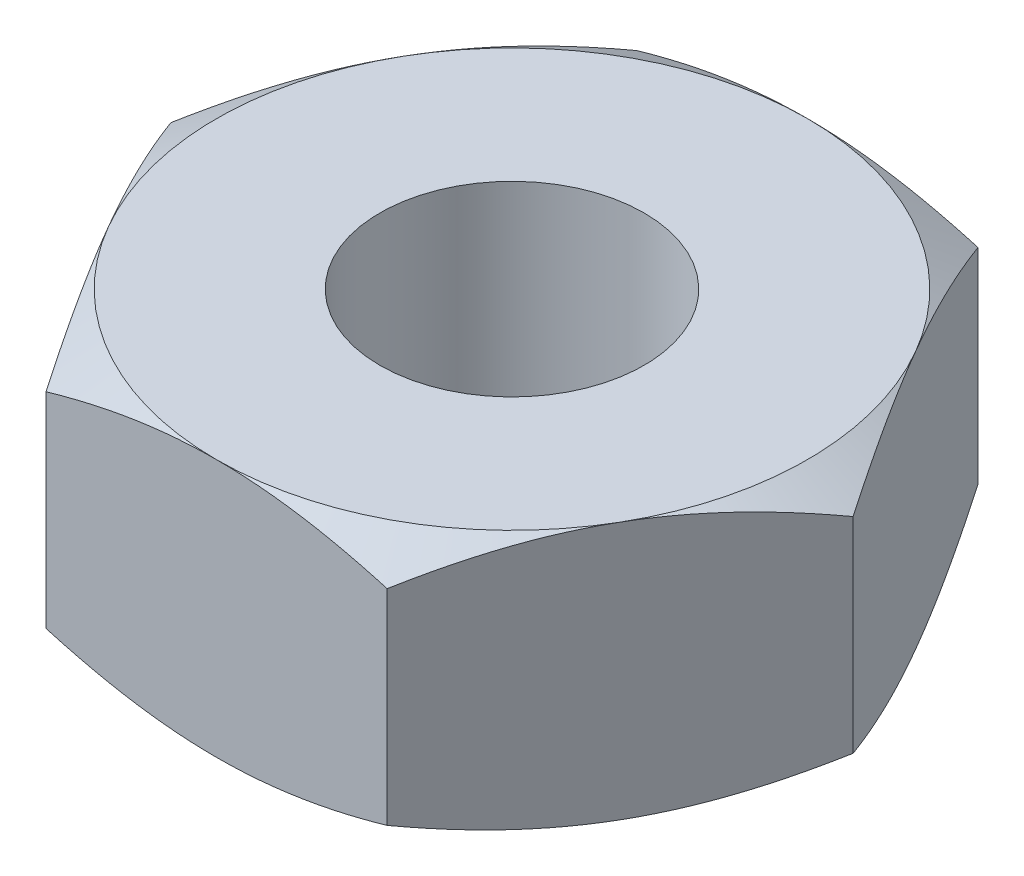
ISO-10303-21;
HEADER;
FILE_DESCRIPTION(('STEP AP214'),'2;1');
FILE_NAME('part.step','',(''),(''),'','','');
FILE_SCHEMA(('AUTOMOTIVE_DESIGN { 1 0 10303 214 1 1 1 1 }'));
ENDSEC;
DATA;
#1=APPLICATION_CONTEXT('core data for automotive mechanical design processes');
#2=APPLICATION_PROTOCOL_DEFINITION('international standard','automotive_design',2000,#1);
#3=PRODUCT_CONTEXT('',#1,'mechanical');
#4=PRODUCT('Part','Part','',(#3));
#5=PRODUCT_RELATED_PRODUCT_CATEGORY('part','',(#4));
#6=PRODUCT_DEFINITION_FORMATION('','',#4);
#7=PRODUCT_DEFINITION_CONTEXT('part definition',#1,'design');
#8=PRODUCT_DEFINITION('design','',#6,#7);
#9=PRODUCT_DEFINITION_SHAPE('','',#8);
#10=(LENGTH_UNIT() NAMED_UNIT(*) SI_UNIT(.MILLI.,.METRE.));
#11=(NAMED_UNIT(*) PLANE_ANGLE_UNIT() SI_UNIT($,.RADIAN.));
#12=(NAMED_UNIT(*) SI_UNIT($,.STERADIAN.) SOLID_ANGLE_UNIT());
#13=UNCERTAINTY_MEASURE_WITH_UNIT(LENGTH_MEASURE(1.E-05),#10,'distance_accuracy_value','');
#14=(GEOMETRIC_REPRESENTATION_CONTEXT(3) GLOBAL_UNCERTAINTY_ASSIGNED_CONTEXT((#13)) GLOBAL_UNIT_ASSIGNED_CONTEXT((#10,
#11,#12)) REPRESENTATION_CONTEXT('',''));
#15=CARTESIAN_POINT('',(0.,0.,0.));
#16=DIRECTION('',(0.,0.,1.));
#17=DIRECTION('',(1.,0.,0.));
#18=AXIS2_PLACEMENT_3D('',#15,#16,#17);
#19=CARTESIAN_POINT('',(0.,-0.245620093061863,0.));
#20=DIRECTION('',(0.,-1.,0.));
#21=DIRECTION('',(0.,0.,-1.));
#22=AXIS2_PLACEMENT_3D('',#19,#20,#21);
#23=CONICAL_SURFACE('',#22,3.17542648054294,1.0471975511966);
#24=CARTESIAN_POINT('',(-4.21084949309675,-1.31594843960294,2.75));
#25=CARTESIAN_POINT('',(-4.09010894214089,-1.25759993615224,2.75));
#26=CARTESIAN_POINT('',(-3.96908292065508,-1.19983146511758,2.75));
#27=CARTESIAN_POINT('',(-3.72630558284843,-1.08578603842305,2.75));
#28=CARTESIAN_POINT('',(-3.604554145362,-1.02950934100247,2.75));
#29=CARTESIAN_POINT('',(-3.35951393034354,-0.918482443352757,2.75));
#30=CARTESIAN_POINT('',(-3.23622034236436,-0.863742821605837,2.75));
#31=CARTESIAN_POINT('',(-2.98861980138743,-0.756614777476453,2.75));
#32=CARTESIAN_POINT('',(-2.86431290161181,-0.704226232536763,2.75));
#33=CARTESIAN_POINT('',(-2.61294485887171,-0.601803572146122,2.75));
#34=CARTESIAN_POINT('',(-2.48586863815654,-0.551806257898392,2.75));
#35=CARTESIAN_POINT('',(-2.2302173217154,-0.4557274087846,2.75));
#36=CARTESIAN_POINT('',(-2.10164206103363,-0.40964630957697,2.75));
#37=CARTESIAN_POINT('',(-1.84305218799467,-0.32263807704623,2.75));
#38=CARTESIAN_POINT('',(-1.71304130052583,-0.281699986413887,2.75));
#39=CARTESIAN_POINT('',(-1.45117125062147,-0.206307307624347,2.75));
#40=CARTESIAN_POINT('',(-1.31931268690202,-0.171850669152766,2.75));
#41=CARTESIAN_POINT('',(-1.05365722480012,-0.111093671530903,2.75));
#42=CARTESIAN_POINT('',(-0.919859820217587,-0.0847954840951206,2.75));
#43=CARTESIAN_POINT('',(-0.650651874037377,-0.0421260371966104,2.75));
#44=CARTESIAN_POINT('',(-0.51524133101359,-0.0257547865105424,2.75));
#45=CARTESIAN_POINT('',(-0.244373242869207,-0.00438749654023711,2.75));
#46=CARTESIAN_POINT('',(-0.108921526377129,0.000680556773216095,2.75));
#47=CARTESIAN_POINT('',(0.161887058855138,-0.000827795632672058,2.75));
#48=CARTESIAN_POINT('',(0.297243943089645,-0.0074011786855538,2.75));
#49=CARTESIAN_POINT('',(0.528385436717547,-0.0281041300468441,2.75));
#50=CARTESIAN_POINT('',(0.624425050137505,-0.0395376410301886,2.75));
#51=CARTESIAN_POINT('',(0.815762399811548,-0.0675217196133518,2.75));
#52=CARTESIAN_POINT('',(0.91106001663197,-0.0840730942276832,2.75));
#53=CARTESIAN_POINT('',(1.19576218748917,-0.140535361278286,2.75));
#54=CARTESIAN_POINT('',(1.38383224738497,-0.187239859417295,2.75));
#55=CARTESIAN_POINT('',(1.66525048947486,-0.26779249703058,2.75));
#56=CARTESIAN_POINT('',(1.76006556248558,-0.296803334995503,2.75));
#57=CARTESIAN_POINT('',(1.94870609382216,-0.35769564890659,2.75));
#58=CARTESIAN_POINT('',(2.04253218553696,-0.389575144878505,2.75));
#59=CARTESIAN_POINT('',(2.22880240354985,-0.45554141818645,2.75));
#60=CARTESIAN_POINT('',(2.32125133588452,-0.489614761455535,2.75));
#61=CARTESIAN_POINT('',(2.50543192042629,-0.559761368231111,2.75));
#62=CARTESIAN_POINT('',(2.59716326539579,-0.59583544003732,2.75));
#63=CARTESIAN_POINT('',(2.68856293053346,-0.632712441997486,2.75));
#64=B_SPLINE_CURVE_WITH_KNOTS('',3,(#24,#25,#26,#27,#28,#29,#30,#31,#32,#33,#34,#35,#36,#37,#38,
#39,#40,#41,#42,#43,#44,#45,#46,#47,#48,#49,#50,#51,#52,#53,#54,#55,#56,#57,#58,#59,#60,#61,#62,
#63),.UNSPECIFIED.,.F.,.F.,(4,2,2,2,2,2,2,2,2,2,2,2,2,2,2,2,2,2,2,4),(0.,0.402305607365937,
0.804680408536997,1.20935783819118,1.61401414820818,2.0236383818577,2.43330812457349,
2.842089694796,3.25074173456636,3.65950246109143,4.06826354901184,4.4744128402465,
4.88045669141172,5.17046846817546,5.46052599902452,6.04107275309883,6.33851131304661,
6.63574613017454,6.93130791005792,7.22698998004822),.UNSPECIFIED.);
#65=CARTESIAN_POINT('',(0.,0.,2.75));
#66=VERTEX_POINT('',#65);
#67=CARTESIAN_POINT('',(1.58771324027147,-0.245620093061863,2.75));
#68=VERTEX_POINT('',#67);
#69=EDGE_CURVE('E204',#66,#68,#64,.T.);
#70=ORIENTED_EDGE('',*,*,#69,.T.);
#71=CARTESIAN_POINT('',(1.58759777021763,-0.245686763364761,2.7502));
#72=CARTESIAN_POINT('',(1.65737010029699,-0.205387662249264,2.62935077934009));
#73=CARTESIAN_POINT('',(1.72774469983533,-0.168736902597662,2.50745839737737));
#74=CARTESIAN_POINT('',(1.86971254687003,-0.1047621829698,2.26156287327211));
#75=CARTESIAN_POINT('',(1.94130831721583,-0.0774608556744964,2.13755536142614));
#76=CARTESIAN_POINT('',(2.08361254889599,-0.0349617452941152,1.89107720202405));
#77=CARTESIAN_POINT('',(2.15429911309864,-0.0194811186224558,1.76864448141258));
#78=CARTESIAN_POINT('',(2.29600490065922,-0.000999397369937971,1.52320285763108));
#79=CARTESIAN_POINT('',(2.36702360884403,0.00201700053740292,1.40019484676709));
#80=CARTESIAN_POINT('',(2.49972966594897,-0.00425314542854377,1.1703412133892));
#81=CARTESIAN_POINT('',(2.56143686540072,-0.0120001542766992,1.06346120874598));
#82=CARTESIAN_POINT('',(2.68444923614046,-0.0365551810643514,0.850397532665249));
#83=CARTESIAN_POINT('',(2.74575398185007,-0.0533715896505668,0.74421459835111));
#84=CARTESIAN_POINT('',(2.86902004703206,-0.0954119223459526,0.530711510606816));
#85=CARTESIAN_POINT('',(2.93096576264317,-0.120814080687227,0.423418383857145));
#86=CARTESIAN_POINT('',(3.05393320806133,-0.178467225839977,0.210432520715949));
#87=CARTESIAN_POINT('',(3.11495651365994,-0.210704663298978,0.104737054973349));
#88=CARTESIAN_POINT('',(3.17554195059677,-0.245686763364756,-0.00019999999999877));
#89=B_SPLINE_CURVE_WITH_KNOTS('',3,(#71,#72,#73,#74,#75,#76,#77,#78,#79,#80,#81,#82,#83,#84,#85,
#86,#87,#88),.UNSPECIFIED.,.F.,.F.,(4,2,2,2,2,2,2,2,4),(0.,0.435912828725889,0.872873557116333,
1.29901931904672,1.72464171213574,2.09526089052938,2.46622354066374,2.84541551798557,
3.22386274754524),.UNSPECIFIED.);
#90=CARTESIAN_POINT('',(2.38156986040721,0.,1.37499999999999));
#91=VERTEX_POINT('',#90);
#92=EDGE_CURVE('E348',#68,#91,#89,.T.);
#93=ORIENTED_EDGE('',*,*,#92,.T.);
#94=CARTESIAN_POINT('',(0.,0.,0.));
#95=DIRECTION('',(0.,1.,0.));
#96=DIRECTION('',(0.,0.,1.));
#97=AXIS2_PLACEMENT_3D('',#94,#95,#96);
#98=CIRCLE('',#97,2.75);
#99=EDGE_CURVE('E44',#66,#91,#98,.T.);
#100=ORIENTED_EDGE('',*,*,#99,.F.);
#101=EDGE_LOOP('',(#70,#93,#100));
#102=FACE_BOUND('',#101,.T.);
#103=ADVANCED_FACE('F36',(#102),#23,.T.);
#104=CARTESIAN_POINT('',(2.38156986040721,0.,-1.37499999999999));
#105=VERTEX_POINT('',#104);
#106=EDGE_CURVE('E153',#91,#105,#98,.T.);
#107=ORIENTED_EDGE('',*,*,#106,.F.);
#108=CARTESIAN_POINT('',(3.17542648054293,-0.245620093061863,0.));
#109=VERTEX_POINT('',#108);
#110=EDGE_CURVE('E211',#91,#109,#89,.T.);
#111=ORIENTED_EDGE('',*,*,#110,.T.);
#112=CARTESIAN_POINT('',(3.17554195059677,-0.245686763364756,0.000200000000001054));
#113=CARTESIAN_POINT('',(3.10576962051742,-0.205387662249259,-0.120649220659905));
#114=CARTESIAN_POINT('',(3.03539502097907,-0.168736902597658,-0.242541602622633));
#115=CARTESIAN_POINT('',(2.89342717394438,-0.104762182969797,-0.488437126727892));
#116=CARTESIAN_POINT('',(2.82183140359858,-0.0774608556744933,-0.612444638573855));
#117=CARTESIAN_POINT('',(2.67952717191842,-0.034961745294113,-0.858922797975943));
#118=CARTESIAN_POINT('',(2.60884060771577,-0.0194811186224542,-0.981355518587416));
#119=CARTESIAN_POINT('',(2.46713482015518,-0.00099939736993735,-1.22679714236891));
#120=CARTESIAN_POINT('',(2.39611611197037,0.00201700053740308,-1.34980515323291));
#121=CARTESIAN_POINT('',(2.26341005486544,-0.00425314542854441,-1.57965878661079));
#122=CARTESIAN_POINT('',(2.20170285541368,-0.0120001542767003,-1.68653879125402));
#123=CARTESIAN_POINT('',(2.07869048467394,-0.0365551810643532,-1.89960246733475));
#124=CARTESIAN_POINT('',(2.01738573896433,-0.0533715896505691,-2.00578540164889));
#125=CARTESIAN_POINT('',(1.89411967378235,-0.0954119223459556,-2.21928848939318));
#126=CARTESIAN_POINT('',(1.83217395817123,-0.12081408068723,-2.32658161614285));
#127=CARTESIAN_POINT('',(1.70920651275308,-0.178467225839982,-2.53956747928405));
#128=CARTESIAN_POINT('',(1.64818320715446,-0.210704663298983,-2.64526294502665));
#129=CARTESIAN_POINT('',(1.58759777021763,-0.245686763364761,-2.7502));
#130=B_SPLINE_CURVE_WITH_KNOTS('',3,(#112,#113,#114,#115,#116,#117,#118,#119,#120,#121,#122,
#123,#124,#125,#126,#127,#128,#129),.UNSPECIFIED.,.F.,.F.,(4,2,2,2,2,2,2,2,4),(0.,
0.435912828725888,0.872873557116331,1.29901931904671,1.72464171213573,2.09526089052937,
2.46622354066374,2.84541551798557,3.22386274754524),.UNSPECIFIED.);
#131=EDGE_CURVE('E222',#109,#105,#130,.T.);
#132=ORIENTED_EDGE('',*,*,#131,.T.);
#133=EDGE_LOOP('',(#107,#111,#132));
#134=FACE_BOUND('',#133,.T.);
#135=ADVANCED_FACE('F334',(#134),#23,.T.);
#136=CARTESIAN_POINT('',(0.,0.,-2.75));
#137=VERTEX_POINT('',#136);
#138=EDGE_CURVE('E152',#105,#137,#98,.T.);
#139=ORIENTED_EDGE('',*,*,#138,.F.);
#140=CARTESIAN_POINT('',(1.58771324027147,-0.245620093061863,-2.75));
#141=VERTEX_POINT('',#140);
#142=EDGE_CURVE('E217',#105,#141,#130,.T.);
#143=ORIENTED_EDGE('',*,*,#142,.T.);
#144=CARTESIAN_POINT('',(-4.21084949309675,-1.31594843960294,-2.75));
#145=CARTESIAN_POINT('',(-4.09010894214089,-1.25759993615224,-2.75));
#146=CARTESIAN_POINT('',(-3.96908292065509,-1.19983146511759,-2.75));
#147=CARTESIAN_POINT('',(-3.72630558284843,-1.08578603842305,-2.75));
#148=CARTESIAN_POINT('',(-3.604554145362,-1.02950934100247,-2.75));
#149=CARTESIAN_POINT('',(-3.35951393034354,-0.918482443352757,-2.75));
#150=CARTESIAN_POINT('',(-3.23622034236436,-0.863742821605838,-2.75));
#151=CARTESIAN_POINT('',(-2.98861980138743,-0.756614777476453,-2.75));
#152=CARTESIAN_POINT('',(-2.86431290161181,-0.704226232536763,-2.75));
#153=CARTESIAN_POINT('',(-2.61294485887171,-0.601803572146122,-2.75));
#154=CARTESIAN_POINT('',(-2.48586863815654,-0.551806257898392,-2.75));
#155=CARTESIAN_POINT('',(-2.2302173217154,-0.4557274087846,-2.75));
#156=CARTESIAN_POINT('',(-2.10164206103363,-0.40964630957697,-2.75));
#157=CARTESIAN_POINT('',(-1.84305218799467,-0.32263807704623,-2.75));
#158=CARTESIAN_POINT('',(-1.71304130052583,-0.281699986413887,-2.75));
#159=CARTESIAN_POINT('',(-1.45117125062147,-0.206307307624347,-2.75));
#160=CARTESIAN_POINT('',(-1.31931268690202,-0.171850669152766,-2.75));
#161=CARTESIAN_POINT('',(-1.05365722480012,-0.111093671530903,-2.75));
#162=CARTESIAN_POINT('',(-0.919859820217587,-0.0847954840951204,-2.75));
#163=CARTESIAN_POINT('',(-0.650651874037376,-0.0421260371966104,-2.75));
#164=CARTESIAN_POINT('',(-0.51524133101359,-0.0257547865105425,-2.75));
#165=CARTESIAN_POINT('',(-0.244373242869206,-0.00438749654023714,-2.75));
#166=CARTESIAN_POINT('',(-0.108921526377129,0.000680556773216272,-2.75));
#167=CARTESIAN_POINT('',(0.161887058855138,-0.00082779563267182,-2.75));
#168=CARTESIAN_POINT('',(0.297243943089645,-0.00740117868555371,-2.75));
#169=CARTESIAN_POINT('',(0.528385436717546,-0.028104130046844,-2.75));
#170=CARTESIAN_POINT('',(0.624425050137505,-0.0395376410301885,-2.75));
#171=CARTESIAN_POINT('',(0.815762399811547,-0.0675217196133513,-2.75));
#172=CARTESIAN_POINT('',(0.91106001663197,-0.0840730942276826,-2.75));
#173=CARTESIAN_POINT('',(1.19576218748917,-0.140535361278285,-2.75));
#174=CARTESIAN_POINT('',(1.38383224738497,-0.187239859417295,-2.75));
#175=CARTESIAN_POINT('',(1.66525048947486,-0.26779249703058,-2.75));
#176=CARTESIAN_POINT('',(1.76006556248558,-0.296803334995502,-2.75));
#177=CARTESIAN_POINT('',(1.94870609382216,-0.357695648906589,-2.75));
#178=CARTESIAN_POINT('',(2.04253218553696,-0.389575144878505,-2.75));
#179=CARTESIAN_POINT('',(2.22880240354985,-0.45554141818645,-2.75));
#180=CARTESIAN_POINT('',(2.32125133588452,-0.489614761455534,-2.75));
#181=CARTESIAN_POINT('',(2.50543192042629,-0.559761368231111,-2.75));
#182=CARTESIAN_POINT('',(2.59716326539579,-0.595835440037319,-2.75));
#183=CARTESIAN_POINT('',(2.68856293053346,-0.632712441997485,-2.75));
#184=B_SPLINE_CURVE_WITH_KNOTS('',3,(#144,#145,#146,#147,#148,#149,#150,#151,#152,#153,#154,
#155,#156,#157,#158,#159,#160,#161,#162,#163,#164,#165,#166,#167,#168,#169,#170,#171,#172,#173,
#174,#175,#176,#177,#178,#179,#180,#181,#182,#183),.UNSPECIFIED.,.F.,.F.,(4,2,2,2,2,2,2,2,2,2,2,
2,2,2,2,2,2,2,2,4),(0.,0.402305607365936,0.804680408536996,1.20935783819118,1.61401414820818,
2.0236383818577,2.43330812457349,2.842089694796,3.25074173456636,3.65950246109143,
4.06826354901184,4.4744128402465,4.88045669141172,5.17046846817546,5.46052599902452,
6.04107275309883,6.33851131304661,6.63574613017455,6.93130791005792,7.22698998004822),.UNSPECIFIED.);
#185=EDGE_CURVE('E163',#141,#137,#184,.F.);
#186=ORIENTED_EDGE('',*,*,#185,.T.);
#187=EDGE_LOOP('',(#139,#143,#186));
#188=FACE_BOUND('',#187,.T.);
#189=ADVANCED_FACE('F338',(#188),#23,.T.);
#190=CARTESIAN_POINT('',(-3.17554195059677,-0.245686763364755,-0.000199999999999724));
#191=CARTESIAN_POINT('',(-3.10576962051742,-0.205387662249258,0.120649220659907));
#192=CARTESIAN_POINT('',(-3.03539502097907,-0.168736902597657,0.242541602622634));
#193=CARTESIAN_POINT('',(-2.89342717394438,-0.104762182969796,0.488437126727893));
#194=CARTESIAN_POINT('',(-2.82183140359857,-0.0774608556744922,0.612444638573855));
#195=CARTESIAN_POINT('',(-2.67952717191842,-0.0349617452941121,0.858922797975944));
#196=CARTESIAN_POINT('',(-2.60884060771576,-0.0194811186224534,0.981355518587417));
#197=CARTESIAN_POINT('',(-2.46713482015518,-0.00099939736993652,1.22679714236891));
#198=CARTESIAN_POINT('',(-2.39611611197037,0.00201700053740403,1.34980515323291));
#199=CARTESIAN_POINT('',(-2.26341005486544,-0.00425314542854339,1.57965878661079));
#200=CARTESIAN_POINT('',(-2.20170285541368,-0.0120001542766993,1.68653879125402));
#201=CARTESIAN_POINT('',(-2.07869048467394,-0.0365551810643523,1.89960246733475));
#202=CARTESIAN_POINT('',(-2.01738573896433,-0.0533715896505681,2.00578540164889));
#203=CARTESIAN_POINT('',(-1.89411967378235,-0.0954119223459549,2.21928848939318));
#204=CARTESIAN_POINT('',(-1.83217395817123,-0.12081408068723,2.32658161614285));
#205=CARTESIAN_POINT('',(-1.70920651275307,-0.178467225839981,2.53956747928405));
#206=CARTESIAN_POINT('',(-1.64818320715446,-0.210704663298982,2.64526294502665));
#207=CARTESIAN_POINT('',(-1.58759777021763,-0.245686763364761,2.7502));
#208=B_SPLINE_CURVE_WITH_KNOTS('',3,(#190,#191,#192,#193,#194,#195,#196,#197,#198,#199,#200,
#201,#202,#203,#204,#205,#206,#207),.UNSPECIFIED.,.F.,.F.,(4,2,2,2,2,2,2,2,4),(0.,
0.435912828725887,0.87287355711633,1.29901931904671,1.72464171213573,2.09526089052937,
2.46622354066374,2.84541551798557,3.22386274754524),.UNSPECIFIED.);
#209=CARTESIAN_POINT('',(-2.3815698604072,0.,1.37499999999999));
#210=VERTEX_POINT('',#209);
#211=CARTESIAN_POINT('',(-1.58771324027147,-0.245620093061863,2.75));
#212=VERTEX_POINT('',#211);
#213=EDGE_CURVE('E196',#210,#212,#208,.T.);
#214=ORIENTED_EDGE('',*,*,#213,.T.);
#215=EDGE_CURVE('E246',#212,#66,#64,.T.);
#216=ORIENTED_EDGE('',*,*,#215,.T.);
#217=EDGE_CURVE('E147',#210,#66,#98,.T.);
#218=ORIENTED_EDGE('',*,*,#217,.F.);
#219=EDGE_LOOP('',(#214,#216,#218));
#220=FACE_BOUND('',#219,.T.);
#221=ADVANCED_FACE('F343',(#220),#23,.T.);
#222=CARTESIAN_POINT('',(-2.3815698604072,0.,-1.37499999999999));
#223=VERTEX_POINT('',#222);
#224=EDGE_CURVE('E136',#137,#223,#98,.T.);
#225=ORIENTED_EDGE('',*,*,#224,.F.);
#226=CARTESIAN_POINT('',(-1.58771324027147,-0.245620093061863,-2.75));
#227=VERTEX_POINT('',#226);
#228=EDGE_CURVE('E138',#137,#227,#184,.F.);
#229=ORIENTED_EDGE('',*,*,#228,.T.);
#230=CARTESIAN_POINT('',(-1.58759777021763,-0.245686763364761,-2.7502));
#231=CARTESIAN_POINT('',(-1.65737010029698,-0.205387662249263,-2.62935077934009));
#232=CARTESIAN_POINT('',(-1.72774469983533,-0.168736902597662,-2.50745839737737));
#233=CARTESIAN_POINT('',(-1.86971254687002,-0.1047621829698,-2.26156287327211));
#234=CARTESIAN_POINT('',(-1.94130831721583,-0.0774608556744958,-2.13755536142614));
#235=CARTESIAN_POINT('',(-2.08361254889598,-0.0349617452941144,-1.89107720202405));
#236=CARTESIAN_POINT('',(-2.15429911309864,-0.0194811186224548,-1.76864448141258));
#237=CARTESIAN_POINT('',(-2.29600490065922,-0.000999397369936862,-1.52320285763108));
#238=CARTESIAN_POINT('',(-2.36702360884403,0.00201700053740397,-1.40019484676709));
#239=CARTESIAN_POINT('',(-2.49972966594896,-0.00425314542854269,-1.1703412133892));
#240=CARTESIAN_POINT('',(-2.56143686540072,-0.0120001542766981,-1.06346120874598));
#241=CARTESIAN_POINT('',(-2.68444923614046,-0.0365551810643501,-0.850397532665249));
#242=CARTESIAN_POINT('',(-2.74575398185007,-0.0533715896505654,-0.744214598351109));
#243=CARTESIAN_POINT('',(-2.86902004703205,-0.0954119223459512,-0.530711510606815));
#244=CARTESIAN_POINT('',(-2.93096576264317,-0.120814080687226,-0.423418383857144));
#245=CARTESIAN_POINT('',(-3.05393320806133,-0.178467225839977,-0.210432520715948));
#246=CARTESIAN_POINT('',(-3.11495651365994,-0.210704663298977,-0.104737054973347));
#247=CARTESIAN_POINT('',(-3.17554195059677,-0.245686763364755,0.000200000000000562));
#248=B_SPLINE_CURVE_WITH_KNOTS('',3,(#230,#231,#232,#233,#234,#235,#236,#237,#238,#239,#240,
#241,#242,#243,#244,#245,#246,#247),.UNSPECIFIED.,.F.,.F.,(4,2,2,2,2,2,2,2,4),(0.,
0.435912828725889,0.872873557116333,1.29901931904672,1.72464171213574,2.09526089052938,
2.46622354066374,2.84541551798557,3.22386274754524),.UNSPECIFIED.);
#249=EDGE_CURVE('E125',#227,#223,#248,.T.);
#250=ORIENTED_EDGE('',*,*,#249,.T.);
#251=EDGE_LOOP('',(#225,#229,#250));
#252=FACE_BOUND('',#251,.T.);
#253=ADVANCED_FACE('F134',(#252),#23,.T.);
#254=CARTESIAN_POINT('',(0.,-2.4,0.));
#255=DIRECTION('',(0.,1.,0.));
#256=DIRECTION('',(0.,0.,1.));
#257=AXIS2_PLACEMENT_3D('',#254,#255,#256);
#258=CONICAL_SURFACE('',#257,2.75,1.0471975511966);
#259=CARTESIAN_POINT('',(-3.17554195059677,-2.15431323663524,0.000200000000000276));
#260=CARTESIAN_POINT('',(-3.10576962051742,-2.19461233775074,-0.120649220659905));
#261=CARTESIAN_POINT('',(-3.03539502097907,-2.23126309740234,-0.242541602622633));
#262=CARTESIAN_POINT('',(-2.89342717394438,-2.2952378170302,-0.488437126727892));
#263=CARTESIAN_POINT('',(-2.82183140359857,-2.32253914432551,-0.612444638573855));
#264=CARTESIAN_POINT('',(-2.67952717191842,-2.36503825470589,-0.858922797975943));
#265=CARTESIAN_POINT('',(-2.60884060771576,-2.38051888137755,-0.981355518587416));
#266=CARTESIAN_POINT('',(-2.46713482015518,-2.39900060263006,-1.22679714236891));
#267=CARTESIAN_POINT('',(-2.39611611197037,-2.4020170005374,-1.34980515323291));
#268=CARTESIAN_POINT('',(-2.26341005486544,-2.39574685457146,-1.57965878661079));
#269=CARTESIAN_POINT('',(-2.20170285541368,-2.3879998457233,-1.68653879125402));
#270=CARTESIAN_POINT('',(-2.07869048467394,-2.36344481893565,-1.89960246733475));
#271=CARTESIAN_POINT('',(-2.01738573896433,-2.34662841034943,-2.00578540164889));
#272=CARTESIAN_POINT('',(-1.89411967378235,-2.30458807765404,-2.21928848939318));
#273=CARTESIAN_POINT('',(-1.83217395817123,-2.27918591931277,-2.32658161614285));
#274=CARTESIAN_POINT('',(-1.70920651275307,-2.22153277416002,-2.53956747928405));
#275=CARTESIAN_POINT('',(-1.64818320715446,-2.18929533670102,-2.64526294502665));
#276=CARTESIAN_POINT('',(-1.58759777021763,-2.15431323663524,-2.7502));
#277=B_SPLINE_CURVE_WITH_KNOTS('',3,(#259,#260,#261,#262,#263,#264,#265,#266,#267,#268,#269,
#270,#271,#272,#273,#274,#275,#276),.UNSPECIFIED.,.F.,.F.,(4,2,2,2,2,2,2,2,4),(0.,
0.435912828725888,0.87287355711633,1.29901931904671,1.72464171213573,2.09526089052937,
2.46622354066374,2.84541551798557,3.22386274754524),.UNSPECIFIED.);
#278=CARTESIAN_POINT('',(-2.3815698604072,-2.4,-1.37499999999999));
#279=VERTEX_POINT('',#278);
#280=CARTESIAN_POINT('',(-1.58771324027147,-2.15437990693814,-2.75));
#281=VERTEX_POINT('',#280);
#282=EDGE_CURVE('E280',#279,#281,#277,.T.);
#283=ORIENTED_EDGE('',*,*,#282,.T.);
#284=CARTESIAN_POINT('',(-4.21084949309675,-1.08405156039706,-2.75));
#285=CARTESIAN_POINT('',(-4.09010894214089,-1.14240006384776,-2.75));
#286=CARTESIAN_POINT('',(-3.96908292065508,-1.20016853488242,-2.75));
#287=CARTESIAN_POINT('',(-3.72630558284843,-1.31421396157695,-2.75));
#288=CARTESIAN_POINT('',(-3.604554145362,-1.37049065899753,-2.75));
#289=CARTESIAN_POINT('',(-3.35951393034354,-1.48151755664724,-2.75));
#290=CARTESIAN_POINT('',(-3.23622034236436,-1.53625717839416,-2.75));
#291=CARTESIAN_POINT('',(-2.98861980138743,-1.64338522252355,-2.75));
#292=CARTESIAN_POINT('',(-2.86431290161181,-1.69577376746324,-2.75));
#293=CARTESIAN_POINT('',(-2.61294485887171,-1.79819642785388,-2.75));
#294=CARTESIAN_POINT('',(-2.48586863815654,-1.84819374210161,-2.75));
#295=CARTESIAN_POINT('',(-2.2302173217154,-1.9442725912154,-2.75));
#296=CARTESIAN_POINT('',(-2.10164206103363,-1.99035369042303,-2.75));
#297=CARTESIAN_POINT('',(-1.84305218799467,-2.07736192295377,-2.75));
#298=CARTESIAN_POINT('',(-1.71304130052583,-2.11830001358611,-2.75));
#299=CARTESIAN_POINT('',(-1.45117125062147,-2.19369269237565,-2.75));
#300=CARTESIAN_POINT('',(-1.31931268690202,-2.22814933084723,-2.75));
#301=CARTESIAN_POINT('',(-1.05365722480012,-2.2889063284691,-2.75));
#302=CARTESIAN_POINT('',(-0.919859820217587,-2.31520451590488,-2.75));
#303=CARTESIAN_POINT('',(-0.650651874037377,-2.35787396280339,-2.75));
#304=CARTESIAN_POINT('',(-0.515241331013591,-2.37424521348946,-2.75));
#305=CARTESIAN_POINT('',(-0.244373242869207,-2.39561250345976,-2.75));
#306=CARTESIAN_POINT('',(-0.10892152637713,-2.40068055677322,-2.75));
#307=CARTESIAN_POINT('',(0.161887058855138,-2.39917220436733,-2.75));
#308=CARTESIAN_POINT('',(0.297243943089644,-2.39259882131445,-2.75));
#309=CARTESIAN_POINT('',(0.528385436717546,-2.37189586995316,-2.75));
#310=CARTESIAN_POINT('',(0.624425050137505,-2.36046235896981,-2.75));
#311=CARTESIAN_POINT('',(0.815762399811548,-2.33247828038665,-2.75));
#312=CARTESIAN_POINT('',(0.911060016631971,-2.31592690577232,-2.75));
#313=CARTESIAN_POINT('',(1.19576218748917,-2.25946463872171,-2.75));
#314=CARTESIAN_POINT('',(1.38383224738497,-2.21276014058271,-2.75));
#315=CARTESIAN_POINT('',(1.66525048947486,-2.13220750296942,-2.75));
#316=CARTESIAN_POINT('',(1.76006556248559,-2.1031966650045,-2.75));
#317=CARTESIAN_POINT('',(1.94870609382216,-2.04230435109341,-2.75));
#318=CARTESIAN_POINT('',(2.04253218553697,-2.01042485512149,-2.75));
#319=CARTESIAN_POINT('',(2.22880240354985,-1.94445858181355,-2.75));
#320=CARTESIAN_POINT('',(2.32125133588452,-1.91038523854447,-2.75));
#321=CARTESIAN_POINT('',(2.50543192042629,-1.84023863176889,-2.75));
#322=CARTESIAN_POINT('',(2.5971632653958,-1.80416455996268,-2.75));
#323=CARTESIAN_POINT('',(2.68856293053346,-1.76728755800251,-2.75));
#324=B_SPLINE_CURVE_WITH_KNOTS('',3,(#284,#285,#286,#287,#288,#289,#290,#291,#292,#293,#294,
#295,#296,#297,#298,#299,#300,#301,#302,#303,#304,#305,#306,#307,#308,#309,#310,#311,#312,#313,
#314,#315,#316,#317,#318,#319,#320,#321,#322,#323),.UNSPECIFIED.,.F.,.F.,(4,2,2,2,2,2,2,2,2,2,2,
2,2,2,2,2,2,2,2,4),(0.,0.402305607365937,0.804680408536998,1.20935783819118,1.61401414820819,
2.0236383818577,2.43330812457349,2.842089694796,3.25074173456636,3.65950246109143,
4.06826354901183,4.4744128402465,4.88045669141172,5.17046846817546,5.46052599902452,
6.04107275309883,6.33851131304661,6.63574613017455,6.93130791005792,7.22698998004822),.UNSPECIFIED.);
#325=CARTESIAN_POINT('',(0.,-2.4,-2.75));
#326=VERTEX_POINT('',#325);
#327=EDGE_CURVE('E170',#281,#326,#324,.T.);
#328=ORIENTED_EDGE('',*,*,#327,.T.);
#329=CARTESIAN_POINT('',(0.,-2.4,0.));
#330=DIRECTION('',(0.,1.,0.));
#331=DIRECTION('',(0.,0.,1.));
#332=AXIS2_PLACEMENT_3D('',#329,#330,#331);
#333=CIRCLE('',#332,2.75);
#334=EDGE_CURVE('E308',#326,#279,#333,.T.);
#335=ORIENTED_EDGE('',*,*,#334,.T.);
#336=EDGE_LOOP('',(#283,#328,#335));
#337=FACE_BOUND('',#336,.T.);
#338=ADVANCED_FACE('F307',(#337),#258,.T.);
#339=CARTESIAN_POINT('',(2.38156986040721,-2.4,-1.37499999999999));
#340=VERTEX_POINT('',#339);
#341=EDGE_CURVE('E320',#340,#326,#333,.T.);
#342=ORIENTED_EDGE('',*,*,#341,.T.);
#343=CARTESIAN_POINT('',(1.58771324027147,-2.15437990693814,-2.75));
#344=VERTEX_POINT('',#343);
#345=EDGE_CURVE('E171',#326,#344,#324,.T.);
#346=ORIENTED_EDGE('',*,*,#345,.T.);
#347=CARTESIAN_POINT('',(1.58759777021763,-2.15431323663524,-2.7502));
#348=CARTESIAN_POINT('',(1.65737010029699,-2.19461233775074,-2.62935077934009));
#349=CARTESIAN_POINT('',(1.72774469983533,-2.23126309740234,-2.50745839737736));
#350=CARTESIAN_POINT('',(1.86971254687003,-2.2952378170302,-2.26156287327211));
#351=CARTESIAN_POINT('',(1.94130831721583,-2.3225391443255,-2.13755536142614));
#352=CARTESIAN_POINT('',(2.08361254889599,-2.36503825470588,-1.89107720202405));
#353=CARTESIAN_POINT('',(2.15429911309864,-2.38051888137754,-1.76864448141258));
#354=CARTESIAN_POINT('',(2.29600490065922,-2.39900060263006,-1.52320285763108));
#355=CARTESIAN_POINT('',(2.36702360884403,-2.4020170005374,-1.40019484676708));
#356=CARTESIAN_POINT('',(2.49972966594897,-2.39574685457146,-1.1703412133892));
#357=CARTESIAN_POINT('',(2.56143686540072,-2.3879998457233,-1.06346120874598));
#358=CARTESIAN_POINT('',(2.68444923614046,-2.36344481893565,-0.850397532665247));
#359=CARTESIAN_POINT('',(2.74575398185007,-2.34662841034943,-0.744214598351108));
#360=CARTESIAN_POINT('',(2.86902004703206,-2.30458807765405,-0.530711510606814));
#361=CARTESIAN_POINT('',(2.93096576264318,-2.27918591931277,-0.423418383857143));
#362=CARTESIAN_POINT('',(3.05393320806133,-2.22153277416002,-0.210432520715947));
#363=CARTESIAN_POINT('',(3.11495651365994,-2.18929533670102,-0.104737054973346));
#364=CARTESIAN_POINT('',(3.17554195059677,-2.15431323663524,0.000200000000001183));
#365=B_SPLINE_CURVE_WITH_KNOTS('',3,(#347,#348,#349,#350,#351,#352,#353,#354,#355,#356,#357,
#358,#359,#360,#361,#362,#363,#364),.UNSPECIFIED.,.F.,.F.,(4,2,2,2,2,2,2,2,4),(0.,
0.435912828725889,0.872873557116333,1.29901931904672,1.72464171213574,2.09526089052937,
2.46622354066374,2.84541551798557,3.22386274754524),.UNSPECIFIED.);
#366=EDGE_CURVE('E223',#344,#340,#365,.T.);
#367=ORIENTED_EDGE('',*,*,#366,.T.);
#368=EDGE_LOOP('',(#342,#346,#367));
#369=FACE_BOUND('',#368,.T.);
#370=ADVANCED_FACE('F331',(#369),#258,.T.);
#371=CARTESIAN_POINT('',(2.38156986040721,-2.4,1.37499999999999));
#372=VERTEX_POINT('',#371);
#373=EDGE_CURVE('E158',#372,#340,#333,.T.);
#374=ORIENTED_EDGE('',*,*,#373,.T.);
#375=CARTESIAN_POINT('',(3.17542648054293,-2.15437990693814,0.));
#376=VERTEX_POINT('',#375);
#377=EDGE_CURVE('E224',#340,#376,#365,.T.);
#378=ORIENTED_EDGE('',*,*,#377,.T.);
#379=CARTESIAN_POINT('',(3.17554195059677,-2.15431323663524,-0.000199999999998946));
#380=CARTESIAN_POINT('',(3.10576962051742,-2.19461233775074,0.120649220659907));
#381=CARTESIAN_POINT('',(3.03539502097907,-2.23126309740234,0.242541602622635));
#382=CARTESIAN_POINT('',(2.89342717394438,-2.2952378170302,0.488437126727893));
#383=CARTESIAN_POINT('',(2.82183140359858,-2.32253914432551,0.612444638573856));
#384=CARTESIAN_POINT('',(2.67952717191842,-2.36503825470589,0.858922797975944));
#385=CARTESIAN_POINT('',(2.60884060771577,-2.38051888137755,0.981355518587418));
#386=CARTESIAN_POINT('',(2.46713482015518,-2.39900060263006,1.22679714236892));
#387=CARTESIAN_POINT('',(2.39611611197037,-2.4020170005374,1.34980515323291));
#388=CARTESIAN_POINT('',(2.26341005486544,-2.39574685457145,1.57965878661079));
#389=CARTESIAN_POINT('',(2.20170285541368,-2.3879998457233,1.68653879125402));
#390=CARTESIAN_POINT('',(2.07869048467394,-2.36344481893565,1.89960246733475));
#391=CARTESIAN_POINT('',(2.01738573896433,-2.34662841034943,2.00578540164889));
#392=CARTESIAN_POINT('',(1.89411967378235,-2.30458807765404,2.21928848939318));
#393=CARTESIAN_POINT('',(1.83217395817123,-2.27918591931277,2.32658161614285));
#394=CARTESIAN_POINT('',(1.70920651275307,-2.22153277416002,2.53956747928405));
#395=CARTESIAN_POINT('',(1.64818320715446,-2.18929533670102,2.64526294502665));
#396=CARTESIAN_POINT('',(1.58759777021763,-2.15431323663524,2.7502));
#397=B_SPLINE_CURVE_WITH_KNOTS('',3,(#379,#380,#381,#382,#383,#384,#385,#386,#387,#388,#389,
#390,#391,#392,#393,#394,#395,#396),.UNSPECIFIED.,.F.,.F.,(4,2,2,2,2,2,2,2,4),(0.,
0.435912828725887,0.87287355711633,1.29901931904671,1.72464171213573,2.09526089052937,
2.46622354066374,2.84541551798557,3.22386274754524),.UNSPECIFIED.);
#398=EDGE_CURVE('E245',#376,#372,#397,.T.);
#399=ORIENTED_EDGE('',*,*,#398,.T.);
#400=EDGE_LOOP('',(#374,#378,#399));
#401=FACE_BOUND('',#400,.T.);
#402=ADVANCED_FACE('F326',(#401),#258,.T.);
#403=CARTESIAN_POINT('',(0.,-2.4,2.75));
#404=VERTEX_POINT('',#403);
#405=EDGE_CURVE('E155',#404,#372,#333,.T.);
#406=ORIENTED_EDGE('',*,*,#405,.T.);
#407=CARTESIAN_POINT('',(1.58771324027147,-2.15437990693814,2.75));
#408=VERTEX_POINT('',#407);
#409=EDGE_CURVE('E240',#372,#408,#397,.T.);
#410=ORIENTED_EDGE('',*,*,#409,.T.);
#411=CARTESIAN_POINT('',(-4.21084949309675,-1.08405156039706,2.75));
#412=CARTESIAN_POINT('',(-4.09010894214089,-1.14240006384776,2.75));
#413=CARTESIAN_POINT('',(-3.96908292065508,-1.20016853488242,2.75));
#414=CARTESIAN_POINT('',(-3.72630558284843,-1.31421396157695,2.75));
#415=CARTESIAN_POINT('',(-3.604554145362,-1.37049065899753,2.75));
#416=CARTESIAN_POINT('',(-3.35951393034354,-1.48151755664724,2.75));
#417=CARTESIAN_POINT('',(-3.23622034236436,-1.53625717839416,2.75));
#418=CARTESIAN_POINT('',(-2.98861980138743,-1.64338522252355,2.75));
#419=CARTESIAN_POINT('',(-2.86431290161181,-1.69577376746324,2.75));
#420=CARTESIAN_POINT('',(-2.61294485887171,-1.79819642785388,2.75));
#421=CARTESIAN_POINT('',(-2.48586863815654,-1.84819374210161,2.75));
#422=CARTESIAN_POINT('',(-2.2302173217154,-1.9442725912154,2.75));
#423=CARTESIAN_POINT('',(-2.10164206103363,-1.99035369042303,2.75));
#424=CARTESIAN_POINT('',(-1.84305218799467,-2.07736192295377,2.75));
#425=CARTESIAN_POINT('',(-1.71304130052583,-2.11830001358611,2.75));
#426=CARTESIAN_POINT('',(-1.45117125062147,-2.19369269237565,2.75));
#427=CARTESIAN_POINT('',(-1.31931268690202,-2.22814933084723,2.75));
#428=CARTESIAN_POINT('',(-1.05365722480012,-2.2889063284691,2.75));
#429=CARTESIAN_POINT('',(-0.919859820217587,-2.31520451590488,2.75));
#430=CARTESIAN_POINT('',(-0.650651874037377,-2.35787396280339,2.75));
#431=CARTESIAN_POINT('',(-0.515241331013591,-2.37424521348946,2.75));
#432=CARTESIAN_POINT('',(-0.244373242869207,-2.39561250345976,2.75));
#433=CARTESIAN_POINT('',(-0.108921526377129,-2.40068055677322,2.75));
#434=CARTESIAN_POINT('',(0.161887058855138,-2.39917220436733,2.75));
#435=CARTESIAN_POINT('',(0.297243943089644,-2.39259882131445,2.75));
#436=CARTESIAN_POINT('',(0.528385436717546,-2.37189586995316,2.75));
#437=CARTESIAN_POINT('',(0.624425050137504,-2.36046235896981,2.75));
#438=CARTESIAN_POINT('',(0.815762399811548,-2.33247828038665,2.75));
#439=CARTESIAN_POINT('',(0.91106001663197,-2.31592690577232,2.75));
#440=CARTESIAN_POINT('',(1.19576218748917,-2.25946463872171,2.75));
#441=CARTESIAN_POINT('',(1.38383224738497,-2.2127601405827,2.75));
#442=CARTESIAN_POINT('',(1.66525048947486,-2.13220750296942,2.75));
#443=CARTESIAN_POINT('',(1.76006556248559,-2.1031966650045,2.75));
#444=CARTESIAN_POINT('',(1.94870609382216,-2.04230435109341,2.75));
#445=CARTESIAN_POINT('',(2.04253218553697,-2.01042485512149,2.75));
#446=CARTESIAN_POINT('',(2.22880240354985,-1.94445858181355,2.75));
#447=CARTESIAN_POINT('',(2.32125133588452,-1.91038523854446,2.75));
#448=CARTESIAN_POINT('',(2.50543192042629,-1.84023863176889,2.75));
#449=CARTESIAN_POINT('',(2.5971632653958,-1.80416455996268,2.75));
#450=CARTESIAN_POINT('',(2.68856293053346,-1.76728755800251,2.75));
#451=B_SPLINE_CURVE_WITH_KNOTS('',3,(#411,#412,#413,#414,#415,#416,#417,#418,#419,#420,#421,
#422,#423,#424,#425,#426,#427,#428,#429,#430,#431,#432,#433,#434,#435,#436,#437,#438,#439,#440,
#441,#442,#443,#444,#445,#446,#447,#448,#449,#450),.UNSPECIFIED.,.F.,.F.,(4,2,2,2,2,2,2,2,2,2,2,
2,2,2,2,2,2,2,2,4),(0.,0.402305607365937,0.804680408536996,1.20935783819118,1.61401414820818,
2.0236383818577,2.43330812457349,2.842089694796,3.25074173456636,3.65950246109143,
4.06826354901183,4.4744128402465,4.88045669141171,5.17046846817546,5.46052599902452,
6.04107275309883,6.33851131304661,6.63574613017455,6.93130791005792,7.22698998004823),.UNSPECIFIED.);
#452=EDGE_CURVE('E254',#408,#404,#451,.F.);
#453=ORIENTED_EDGE('',*,*,#452,.T.);
#454=EDGE_LOOP('',(#406,#410,#453));
#455=FACE_BOUND('',#454,.T.);
#456=ADVANCED_FACE('F324',(#455),#258,.T.);
#457=CARTESIAN_POINT('',(-2.3815698604072,-2.4,1.37499999999999));
#458=VERTEX_POINT('',#457);
#459=EDGE_CURVE('E159',#458,#404,#333,.T.);
#460=ORIENTED_EDGE('',*,*,#459,.T.);
#461=CARTESIAN_POINT('',(-1.58771324027147,-2.15437990693814,2.75));
#462=VERTEX_POINT('',#461);
#463=EDGE_CURVE('E258',#404,#462,#451,.F.);
#464=ORIENTED_EDGE('',*,*,#463,.T.);
#465=CARTESIAN_POINT('',(-1.58759777021763,-2.15431323663524,2.7502));
#466=CARTESIAN_POINT('',(-1.65737010029698,-2.19461233775074,2.62935077934009));
#467=CARTESIAN_POINT('',(-1.72774469983533,-2.23126309740234,2.50745839737737));
#468=CARTESIAN_POINT('',(-1.86971254687002,-2.2952378170302,2.26156287327211));
#469=CARTESIAN_POINT('',(-1.94130831721583,-2.3225391443255,2.13755536142614));
#470=CARTESIAN_POINT('',(-2.08361254889598,-2.36503825470589,1.89107720202405));
#471=CARTESIAN_POINT('',(-2.15429911309864,-2.38051888137754,1.76864448141258));
#472=CARTESIAN_POINT('',(-2.29600490065922,-2.39900060263006,1.52320285763108));
#473=CARTESIAN_POINT('',(-2.36702360884403,-2.4020170005374,1.40019484676709));
#474=CARTESIAN_POINT('',(-2.49972966594896,-2.39574685457146,1.1703412133892));
#475=CARTESIAN_POINT('',(-2.56143686540072,-2.3879998457233,1.06346120874598));
#476=CARTESIAN_POINT('',(-2.68444923614046,-2.36344481893565,0.850397532665249));
#477=CARTESIAN_POINT('',(-2.74575398185007,-2.34662841034943,0.74421459835111));
#478=CARTESIAN_POINT('',(-2.86902004703205,-2.30458807765405,0.530711510606816));
#479=CARTESIAN_POINT('',(-2.93096576264317,-2.27918591931277,0.423418383857144));
#480=CARTESIAN_POINT('',(-3.05393320806133,-2.22153277416002,0.210432520715949));
#481=CARTESIAN_POINT('',(-3.11495651365994,-2.18929533670102,0.104737054973348));
#482=CARTESIAN_POINT('',(-3.17554195059677,-2.15431323663524,-0.000199999999999526));
#483=B_SPLINE_CURVE_WITH_KNOTS('',3,(#465,#466,#467,#468,#469,#470,#471,#472,#473,#474,#475,
#476,#477,#478,#479,#480,#481,#482),.UNSPECIFIED.,.F.,.F.,(4,2,2,2,2,2,2,2,4),(0.,
0.435912828725888,0.872873557116333,1.29901931904672,1.72464171213574,2.09526089052937,
2.46622354066374,2.84541551798557,3.22386274754524),.UNSPECIFIED.);
#484=EDGE_CURVE('E266',#462,#458,#483,.T.);
#485=ORIENTED_EDGE('',*,*,#484,.T.);
#486=EDGE_LOOP('',(#460,#464,#485));
#487=FACE_BOUND('',#486,.T.);
#488=ADVANCED_FACE('F321',(#487),#258,.T.);
#489=CARTESIAN_POINT('',(0.,0.,0.));
#490=DIRECTION('',(0.,1.,0.));
#491=DIRECTION('',(0.,0.,1.));
#492=AXIS2_PLACEMENT_3D('',#489,#490,#491);
#493=CYLINDRICAL_SURFACE('',#492,1.2295);
#494=CARTESIAN_POINT('',(0.,-2.4,0.));
#495=DIRECTION('',(0.,1.,0.));
#496=DIRECTION('',(0.,0.,1.));
#497=AXIS2_PLACEMENT_3D('',#494,#495,#496);
#498=CIRCLE('',#497,1.2295);
#499=CARTESIAN_POINT('',(0.,-2.4,1.2295));
#500=VERTEX_POINT('',#499);
#501=EDGE_CURVE('E160',#500,#500,#498,.T.);
#502=ORIENTED_EDGE('',*,*,#501,.F.);
#503=EDGE_LOOP('',(#502));
#504=FACE_BOUND('',#503,.T.);
#505=CARTESIAN_POINT('',(0.,0.,0.));
#506=DIRECTION('',(0.,1.,0.));
#507=DIRECTION('',(0.,0.,1.));
#508=AXIS2_PLACEMENT_3D('',#505,#506,#507);
#509=CIRCLE('',#508,1.2295);
#510=CARTESIAN_POINT('',(0.,0.,1.2295));
#511=VERTEX_POINT('',#510);
#512=EDGE_CURVE('E12',#511,#511,#509,.T.);
#513=ORIENTED_EDGE('',*,*,#512,.T.);
#514=EDGE_LOOP('',(#513));
#515=FACE_BOUND('',#514,.T.);
#516=ADVANCED_FACE('F38',(#504,#515),#493,.F.);
#517=CARTESIAN_POINT('',(1.2295,0.,0.));
#518=DIRECTION('',(0.,-1.,0.));
#519=DIRECTION('',(0.,0.,-1.));
#520=AXIS2_PLACEMENT_3D('',#517,#518,#519);
#521=PLANE('',#520);
#522=ORIENTED_EDGE('',*,*,#512,.F.);
#523=EDGE_LOOP('',(#522));
#524=FACE_BOUND('',#523,.T.);
#525=ORIENTED_EDGE('',*,*,#99,.T.);
#526=ORIENTED_EDGE('',*,*,#106,.T.);
#527=ORIENTED_EDGE('',*,*,#138,.T.);
#528=ORIENTED_EDGE('',*,*,#224,.T.);
#529=EDGE_CURVE('E141',#223,#210,#98,.T.);
#530=ORIENTED_EDGE('',*,*,#529,.T.);
#531=ORIENTED_EDGE('',*,*,#217,.T.);
#532=EDGE_LOOP('',(#525,#526,#527,#528,#530,#531));
#533=FACE_BOUND('',#532,.T.);
#534=ADVANCED_FACE('F149',(#524,#533),#521,.F.);
#535=CARTESIAN_POINT('',(-3.17542648054294,-0.245620093061863,0.));
#536=VERTEX_POINT('',#535);
#537=EDGE_CURVE('E122',#223,#536,#248,.T.);
#538=ORIENTED_EDGE('',*,*,#537,.T.);
#539=EDGE_CURVE('E143',#536,#210,#208,.T.);
#540=ORIENTED_EDGE('',*,*,#539,.T.);
#541=ORIENTED_EDGE('',*,*,#529,.F.);
#542=EDGE_LOOP('',(#538,#540,#541));
#543=FACE_BOUND('',#542,.T.);
#544=ADVANCED_FACE('F142',(#543),#23,.T.);
#545=EDGE_CURVE('E313',#279,#458,#333,.T.);
#546=ORIENTED_EDGE('',*,*,#545,.T.);
#547=CARTESIAN_POINT('',(-3.17542648054293,-2.15437990693814,0.));
#548=VERTEX_POINT('',#547);
#549=EDGE_CURVE('E139',#458,#548,#483,.T.);
#550=ORIENTED_EDGE('',*,*,#549,.T.);
#551=EDGE_CURVE('E129',#548,#279,#277,.T.);
#552=ORIENTED_EDGE('',*,*,#551,.T.);
#553=EDGE_LOOP('',(#546,#550,#552));
#554=FACE_BOUND('',#553,.T.);
#555=ADVANCED_FACE('F183',(#554),#258,.T.);
#556=CARTESIAN_POINT('',(1.2295,-2.4,0.));
#557=DIRECTION('',(0.,1.,0.));
#558=DIRECTION('',(0.,0.,1.));
#559=AXIS2_PLACEMENT_3D('',#556,#557,#558);
#560=PLANE('',#559);
#561=ORIENTED_EDGE('',*,*,#405,.F.);
#562=ORIENTED_EDGE('',*,*,#459,.F.);
#563=ORIENTED_EDGE('',*,*,#545,.F.);
#564=ORIENTED_EDGE('',*,*,#334,.F.);
#565=ORIENTED_EDGE('',*,*,#341,.F.);
#566=ORIENTED_EDGE('',*,*,#373,.F.);
#567=EDGE_LOOP('',(#561,#562,#563,#564,#565,#566));
#568=FACE_BOUND('',#567,.T.);
#569=ORIENTED_EDGE('',*,*,#501,.T.);
#570=EDGE_LOOP('',(#569));
#571=FACE_BOUND('',#570,.T.);
#572=ADVANCED_FACE('F316',(#568,#571),#560,.F.);
#573=CARTESIAN_POINT('',(-1.58771324027147,-2.4,-2.75));
#574=DIRECTION('',(0.,0.,1.));
#575=DIRECTION('',(1.,0.,0.));
#576=AXIS2_PLACEMENT_3D('',#573,#574,#575);
#577=PLANE('',#576);
#578=DIRECTION('',(0.,1.,0.));
#579=VECTOR('',#578,1.);
#580=CARTESIAN_POINT('',(1.58771324027147,-2.4,-2.75));
#581=LINE('',#580,#579);
#582=EDGE_CURVE('E286',#344,#141,#581,.T.);
#583=ORIENTED_EDGE('',*,*,#582,.F.);
#584=ORIENTED_EDGE('',*,*,#345,.F.);
#585=ORIENTED_EDGE('',*,*,#327,.F.);
#586=DIRECTION('',(0.,1.,0.));
#587=VECTOR('',#586,1.);
#588=CARTESIAN_POINT('',(-1.58771324027147,-2.4,-2.75));
#589=LINE('',#588,#587);
#590=EDGE_CURVE('E58',#281,#227,#589,.T.);
#591=ORIENTED_EDGE('',*,*,#590,.T.);
#592=ORIENTED_EDGE('',*,*,#228,.F.);
#593=ORIENTED_EDGE('',*,*,#185,.F.);
#594=EDGE_LOOP('',(#583,#584,#585,#591,#592,#593));
#595=FACE_BOUND('',#594,.T.);
#596=ADVANCED_FACE('F177',(#595),#577,.F.);
#597=CARTESIAN_POINT('',(1.58771324027147,-2.4,-2.75));
#598=DIRECTION('',(-0.86602540378444,0.,0.499999999999998));
#599=DIRECTION('',(0.499999999999998,0.,0.86602540378444));
#600=AXIS2_PLACEMENT_3D('',#597,#598,#599);
#601=PLANE('',#600);
#602=DIRECTION('',(0.,1.,0.));
#603=VECTOR('',#602,1.);
#604=CARTESIAN_POINT('',(3.17542648054293,-2.4,0.));
#605=LINE('',#604,#603);
#606=EDGE_CURVE('E289',#376,#109,#605,.T.);
#607=ORIENTED_EDGE('',*,*,#606,.F.);
#608=ORIENTED_EDGE('',*,*,#377,.F.);
#609=ORIENTED_EDGE('',*,*,#366,.F.);
#610=ORIENTED_EDGE('',*,*,#582,.T.);
#611=ORIENTED_EDGE('',*,*,#142,.F.);
#612=ORIENTED_EDGE('',*,*,#131,.F.);
#613=EDGE_LOOP('',(#607,#608,#609,#610,#611,#612));
#614=FACE_BOUND('',#613,.T.);
#615=ADVANCED_FACE('F228',(#614),#601,.F.);
#616=CARTESIAN_POINT('',(1.58771324027147,-2.4,2.75));
#617=DIRECTION('',(-0.86602540378444,0.,-0.499999999999998));
#618=DIRECTION('',(-0.499999999999998,0.,0.86602540378444));
#619=AXIS2_PLACEMENT_3D('',#616,#617,#618);
#620=PLANE('',#619);
#621=DIRECTION('',(0.,1.,0.));
#622=VECTOR('',#621,1.);
#623=CARTESIAN_POINT('',(1.58771324027147,-2.4,2.75));
#624=LINE('',#623,#622);
#625=EDGE_CURVE('E292',#408,#68,#624,.T.);
#626=ORIENTED_EDGE('',*,*,#625,.F.);
#627=ORIENTED_EDGE('',*,*,#409,.F.);
#628=ORIENTED_EDGE('',*,*,#398,.F.);
#629=ORIENTED_EDGE('',*,*,#606,.T.);
#630=ORIENTED_EDGE('',*,*,#110,.F.);
#631=ORIENTED_EDGE('',*,*,#92,.F.);
#632=EDGE_LOOP('',(#626,#627,#628,#629,#630,#631));
#633=FACE_BOUND('',#632,.T.);
#634=ADVANCED_FACE('F231',(#633),#620,.F.);
#635=CARTESIAN_POINT('',(-1.58771324027147,-2.4,2.75));
#636=DIRECTION('',(0.,0.,-1.));
#637=DIRECTION('',(-1.,0.,0.));
#638=AXIS2_PLACEMENT_3D('',#635,#636,#637);
#639=PLANE('',#638);
#640=DIRECTION('',(0.,1.,0.));
#641=VECTOR('',#640,1.);
#642=CARTESIAN_POINT('',(-1.58771324027147,-2.4,2.75));
#643=LINE('',#642,#641);
#644=EDGE_CURVE('E295',#462,#212,#643,.T.);
#645=ORIENTED_EDGE('',*,*,#644,.F.);
#646=ORIENTED_EDGE('',*,*,#463,.F.);
#647=ORIENTED_EDGE('',*,*,#452,.F.);
#648=ORIENTED_EDGE('',*,*,#625,.T.);
#649=ORIENTED_EDGE('',*,*,#69,.F.);
#650=ORIENTED_EDGE('',*,*,#215,.F.);
#651=EDGE_LOOP('',(#645,#646,#647,#648,#649,#650));
#652=FACE_BOUND('',#651,.T.);
#653=ADVANCED_FACE('F236',(#652),#639,.F.);
#654=CARTESIAN_POINT('',(-1.58771324027147,-2.4,2.75));
#655=DIRECTION('',(0.86602540378444,0.,-0.499999999999998));
#656=DIRECTION('',(-0.499999999999998,0.,-0.86602540378444));
#657=AXIS2_PLACEMENT_3D('',#654,#655,#656);
#658=PLANE('',#657);
#659=DIRECTION('',(0.,1.,0.));
#660=VECTOR('',#659,1.);
#661=CARTESIAN_POINT('',(-3.17542648054293,-2.4,0.));
#662=LINE('',#661,#660);
#663=EDGE_CURVE('E51',#548,#536,#662,.T.);
#664=ORIENTED_EDGE('',*,*,#663,.F.);
#665=ORIENTED_EDGE('',*,*,#549,.F.);
#666=ORIENTED_EDGE('',*,*,#484,.F.);
#667=ORIENTED_EDGE('',*,*,#644,.T.);
#668=ORIENTED_EDGE('',*,*,#213,.F.);
#669=ORIENTED_EDGE('',*,*,#539,.F.);
#670=EDGE_LOOP('',(#664,#665,#666,#667,#668,#669));
#671=FACE_BOUND('',#670,.T.);
#672=ADVANCED_FACE('F272',(#671),#658,.F.);
#673=CARTESIAN_POINT('',(-1.58771324027147,-2.4,-2.75));
#674=DIRECTION('',(0.86602540378444,0.,0.499999999999998));
#675=DIRECTION('',(0.499999999999998,0.,-0.86602540378444));
#676=AXIS2_PLACEMENT_3D('',#673,#674,#675);
#677=PLANE('',#676);
#678=ORIENTED_EDGE('',*,*,#590,.F.);
#679=ORIENTED_EDGE('',*,*,#282,.F.);
#680=ORIENTED_EDGE('',*,*,#551,.F.);
#681=ORIENTED_EDGE('',*,*,#663,.T.);
#682=ORIENTED_EDGE('',*,*,#537,.F.);
#683=ORIENTED_EDGE('',*,*,#249,.F.);
#684=EDGE_LOOP('',(#678,#679,#680,#681,#682,#683));
#685=FACE_BOUND('',#684,.T.);
#686=ADVANCED_FACE('F124',(#685),#677,.F.);
#687=CLOSED_SHELL('',(#103,#135,#189,#221,#253,#338,#370,#402,#456,#488,#516,#534,#544,#555,
#572,#596,#615,#634,#653,#672,#686));
#688=MANIFOLD_SOLID_BREP('B2',#687);
#689=ADVANCED_BREP_SHAPE_REPRESENTATION('',(#18,#688),#14);
#690=SHAPE_DEFINITION_REPRESENTATION(#9,#689);
ENDSEC;
END-ISO-10303-21;
